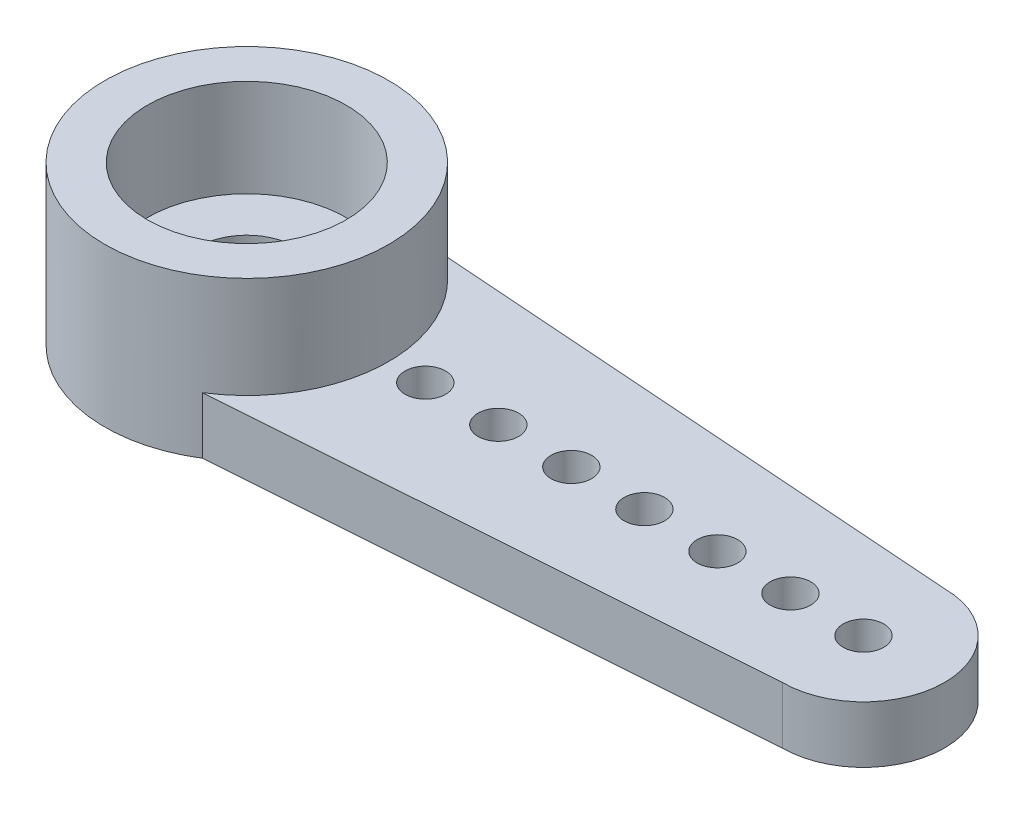
ISO-10303-21;
HEADER;
FILE_DESCRIPTION(('STEP AP214'),'2;1');
FILE_NAME('part.step','',(''),(''),'','','');
FILE_SCHEMA(('AUTOMOTIVE_DESIGN { 1 0 10303 214 1 1 1 1 }'));
ENDSEC;
DATA;
#1=APPLICATION_CONTEXT('core data for automotive mechanical design processes');
#2=APPLICATION_PROTOCOL_DEFINITION('international standard','automotive_design',2000,#1);
#3=PRODUCT_CONTEXT('',#1,'mechanical');
#4=PRODUCT('Part','Part','',(#3));
#5=PRODUCT_RELATED_PRODUCT_CATEGORY('part','',(#4));
#6=PRODUCT_DEFINITION_FORMATION('','',#4);
#7=PRODUCT_DEFINITION_CONTEXT('part definition',#1,'design');
#8=PRODUCT_DEFINITION('design','',#6,#7);
#9=PRODUCT_DEFINITION_SHAPE('','',#8);
#10=(LENGTH_UNIT() NAMED_UNIT(*) SI_UNIT(.MILLI.,.METRE.));
#11=(NAMED_UNIT(*) PLANE_ANGLE_UNIT() SI_UNIT($,.RADIAN.));
#12=(NAMED_UNIT(*) SI_UNIT($,.STERADIAN.) SOLID_ANGLE_UNIT());
#13=UNCERTAINTY_MEASURE_WITH_UNIT(LENGTH_MEASURE(1.E-05),#10,'distance_accuracy_value','');
#14=(GEOMETRIC_REPRESENTATION_CONTEXT(3) GLOBAL_UNCERTAINTY_ASSIGNED_CONTEXT((#13)) GLOBAL_UNIT_ASSIGNED_CONTEXT((#10,
#11,#12)) REPRESENTATION_CONTEXT('',''));
#15=CARTESIAN_POINT('',(0.,0.,0.));
#16=DIRECTION('',(0.,0.,1.));
#17=DIRECTION('',(1.,0.,0.));
#18=AXIS2_PLACEMENT_3D('',#15,#16,#17);
#19=CARTESIAN_POINT('',(-15.2,1.4,0.));
#20=DIRECTION('',(0.,1.,0.));
#21=DIRECTION('',(0.,0.,1.));
#22=AXIS2_PLACEMENT_3D('',#19,#20,#21);
#23=PLANE('',#22);
#24=CARTESIAN_POINT('',(6.2,1.4,0.));
#25=DIRECTION('',(0.,1.,0.));
#26=DIRECTION('',(0.,0.,1.));
#27=AXIS2_PLACEMENT_3D('',#24,#25,#26);
#28=CIRCLE('',#27,0.499999999999997);
#29=CARTESIAN_POINT('',(6.2,1.4,0.500000000000053));
#30=VERTEX_POINT('',#29);
#31=EDGE_CURVE('E125',#30,#30,#28,.T.);
#32=ORIENTED_EDGE('',*,*,#31,.F.);
#33=EDGE_LOOP('',(#32));
#34=FACE_BOUND('',#33,.T.);
#35=CARTESIAN_POINT('',(9.8,1.4,0.));
#36=DIRECTION('',(0.,1.,0.));
#37=DIRECTION('',(0.,0.,1.));
#38=AXIS2_PLACEMENT_3D('',#35,#36,#37);
#39=CIRCLE('',#38,0.499999999999997);
#40=CARTESIAN_POINT('',(9.8,1.4,0.500000000000028));
#41=VERTEX_POINT('',#40);
#42=EDGE_CURVE('E137',#41,#41,#39,.T.);
#43=ORIENTED_EDGE('',*,*,#42,.F.);
#44=EDGE_LOOP('',(#43));
#45=FACE_BOUND('',#44,.T.);
#46=CARTESIAN_POINT('',(13.4,1.4,0.));
#47=DIRECTION('',(0.,1.,0.));
#48=DIRECTION('',(0.,0.,1.));
#49=AXIS2_PLACEMENT_3D('',#46,#47,#48);
#50=CIRCLE('',#49,0.499999999999997);
#51=CARTESIAN_POINT('',(13.4,1.4,0.500000000000003));
#52=VERTEX_POINT('',#51);
#53=EDGE_CURVE('E149',#52,#52,#50,.T.);
#54=ORIENTED_EDGE('',*,*,#53,.F.);
#55=EDGE_LOOP('',(#54));
#56=FACE_BOUND('',#55,.T.);
#57=CARTESIAN_POINT('',(15.2,1.4,0.));
#58=DIRECTION('',(0.,1.,0.));
#59=DIRECTION('',(0.,0.,1.));
#60=AXIS2_PLACEMENT_3D('',#57,#58,#59);
#61=CIRCLE('',#60,0.499999999999997);
#62=CARTESIAN_POINT('',(15.2,1.4,0.49999999999999));
#63=VERTEX_POINT('',#62);
#64=EDGE_CURVE('E155',#63,#63,#61,.T.);
#65=ORIENTED_EDGE('',*,*,#64,.F.);
#66=EDGE_LOOP('',(#65));
#67=FACE_BOUND('',#66,.T.);
#68=CARTESIAN_POINT('',(11.6,1.4,0.));
#69=DIRECTION('',(0.,1.,0.));
#70=DIRECTION('',(0.,0.,1.));
#71=AXIS2_PLACEMENT_3D('',#68,#69,#70);
#72=CIRCLE('',#71,0.499999999999999);
#73=CARTESIAN_POINT('',(11.6,1.4,0.500000000000017));
#74=VERTEX_POINT('',#73);
#75=EDGE_CURVE('E143',#74,#74,#72,.T.);
#76=ORIENTED_EDGE('',*,*,#75,.F.);
#77=EDGE_LOOP('',(#76));
#78=FACE_BOUND('',#77,.T.);
#79=CARTESIAN_POINT('',(8.,1.4,0.));
#80=DIRECTION('',(0.,1.,0.));
#81=DIRECTION('',(0.,0.,1.));
#82=AXIS2_PLACEMENT_3D('',#79,#80,#81);
#83=CIRCLE('',#82,0.499999999999997);
#84=CARTESIAN_POINT('',(8.,1.4,0.500000000000041));
#85=VERTEX_POINT('',#84);
#86=EDGE_CURVE('E131',#85,#85,#83,.T.);
#87=ORIENTED_EDGE('',*,*,#86,.F.);
#88=EDGE_LOOP('',(#87));
#89=FACE_BOUND('',#88,.T.);
#90=CARTESIAN_POINT('',(4.4,1.4,0.));
#91=DIRECTION('',(0.,1.,0.));
#92=DIRECTION('',(0.,0.,1.));
#93=AXIS2_PLACEMENT_3D('',#90,#91,#92);
#94=CIRCLE('',#93,0.499999999999997);
#95=CARTESIAN_POINT('',(4.4,1.4,0.500000000000066));
#96=VERTEX_POINT('',#95);
#97=EDGE_CURVE('E119',#96,#96,#94,.T.);
#98=ORIENTED_EDGE('',*,*,#97,.F.);
#99=EDGE_LOOP('',(#98));
#100=FACE_BOUND('',#99,.T.);
#101=CARTESIAN_POINT('',(0.,1.4,0.));
#102=DIRECTION('',(0.,1.,0.));
#103=DIRECTION('',(0.,0.,1.));
#104=AXIS2_PLACEMENT_3D('',#101,#102,#103);
#105=CIRCLE('',#104,3.5);
#106=CARTESIAN_POINT('',(1.86858471289894,1.4,2.95945791838985));
#107=VERTEX_POINT('',#106);
#108=CARTESIAN_POINT('',(1.86858471289894,1.4,-2.95945791838985));
#109=VERTEX_POINT('',#108);
#110=EDGE_CURVE('E85',#107,#109,#105,.T.);
#111=ORIENTED_EDGE('',*,*,#110,.F.);
#112=DIRECTION('',(0.997420198870011,0.,-0.0717840294641297));
#113=VECTOR('',#112,1.);
#114=CARTESIAN_POINT('',(-14.9001527327747,1.4,4.16629887091939));
#115=LINE('',#114,#113);
#116=CARTESIAN_POINT('',(15.2,1.4,2.));
#117=VERTEX_POINT('',#116);
#118=EDGE_CURVE('E99',#107,#117,#115,.T.);
#119=ORIENTED_EDGE('',*,*,#118,.T.);
#120=CARTESIAN_POINT('',(15.2,1.4,0.));
#121=DIRECTION('',(0.,1.,0.));
#122=DIRECTION('',(0.,0.,-1.));
#123=AXIS2_PLACEMENT_3D('',#120,#121,#122);
#124=CIRCLE('',#123,2.);
#125=CARTESIAN_POINT('',(15.2,1.4,-2.));
#126=VERTEX_POINT('',#125);
#127=EDGE_CURVE('E161',#117,#126,#124,.T.);
#128=ORIENTED_EDGE('',*,*,#127,.T.);
#129=DIRECTION('',(-0.997420198870011,0.,-0.0717840294641295));
#130=VECTOR('',#129,1.);
#131=CARTESIAN_POINT('',(-14.9001527327747,1.4,-4.16629887091939));
#132=LINE('',#131,#130);
#133=EDGE_CURVE('E96',#126,#109,#132,.T.);
#134=ORIENTED_EDGE('',*,*,#133,.T.);
#135=EDGE_LOOP('',(#111,#119,#128,#134));
#136=FACE_BOUND('',#135,.T.);
#137=ADVANCED_FACE('F32',(#34,#45,#56,#67,#78,#89,#100,#136),#23,.T.);
#138=CARTESIAN_POINT('',(-15.2,0.,0.));
#139=DIRECTION('',(0.,1.,0.));
#140=DIRECTION('',(0.,0.,1.));
#141=AXIS2_PLACEMENT_3D('',#138,#139,#140);
#142=PLANE('',#141);
#143=CARTESIAN_POINT('',(0.,0.,0.));
#144=DIRECTION('',(0.,-1.,0.));
#145=DIRECTION('',(0.,0.,-1.));
#146=AXIS2_PLACEMENT_3D('',#143,#144,#145);
#147=CIRCLE('',#146,2.35);
#148=CARTESIAN_POINT('',(0.,0.,-2.35));
#149=VERTEX_POINT('',#148);
#150=EDGE_CURVE('E111',#149,#149,#147,.T.);
#151=ORIENTED_EDGE('',*,*,#150,.F.);
#152=EDGE_LOOP('',(#151));
#153=FACE_BOUND('',#152,.T.);
#154=CARTESIAN_POINT('',(15.2,0.,0.));
#155=DIRECTION('',(0.,1.,0.));
#156=DIRECTION('',(0.,0.,1.));
#157=AXIS2_PLACEMENT_3D('',#154,#155,#156);
#158=CIRCLE('',#157,0.499999999999997);
#159=CARTESIAN_POINT('',(15.2,0.,0.49999999999999));
#160=VERTEX_POINT('',#159);
#161=EDGE_CURVE('E152',#160,#160,#158,.T.);
#162=ORIENTED_EDGE('',*,*,#161,.T.);
#163=EDGE_LOOP('',(#162));
#164=FACE_BOUND('',#163,.T.);
#165=CARTESIAN_POINT('',(13.4,0.,0.));
#166=DIRECTION('',(0.,1.,0.));
#167=DIRECTION('',(0.,0.,1.));
#168=AXIS2_PLACEMENT_3D('',#165,#166,#167);
#169=CIRCLE('',#168,0.499999999999997);
#170=CARTESIAN_POINT('',(13.4,0.,0.500000000000003));
#171=VERTEX_POINT('',#170);
#172=EDGE_CURVE('E146',#171,#171,#169,.T.);
#173=ORIENTED_EDGE('',*,*,#172,.T.);
#174=EDGE_LOOP('',(#173));
#175=FACE_BOUND('',#174,.T.);
#176=CARTESIAN_POINT('',(11.6,0.,0.));
#177=DIRECTION('',(0.,1.,0.));
#178=DIRECTION('',(0.,0.,1.));
#179=AXIS2_PLACEMENT_3D('',#176,#177,#178);
#180=CIRCLE('',#179,0.499999999999999);
#181=CARTESIAN_POINT('',(11.6,0.,0.500000000000017));
#182=VERTEX_POINT('',#181);
#183=EDGE_CURVE('E140',#182,#182,#180,.T.);
#184=ORIENTED_EDGE('',*,*,#183,.T.);
#185=EDGE_LOOP('',(#184));
#186=FACE_BOUND('',#185,.T.);
#187=CARTESIAN_POINT('',(9.8,0.,0.));
#188=DIRECTION('',(0.,1.,0.));
#189=DIRECTION('',(0.,0.,1.));
#190=AXIS2_PLACEMENT_3D('',#187,#188,#189);
#191=CIRCLE('',#190,0.499999999999997);
#192=CARTESIAN_POINT('',(9.8,0.,0.500000000000028));
#193=VERTEX_POINT('',#192);
#194=EDGE_CURVE('E134',#193,#193,#191,.T.);
#195=ORIENTED_EDGE('',*,*,#194,.T.);
#196=EDGE_LOOP('',(#195));
#197=FACE_BOUND('',#196,.T.);
#198=CARTESIAN_POINT('',(8.,0.,0.));
#199=DIRECTION('',(0.,1.,0.));
#200=DIRECTION('',(0.,0.,1.));
#201=AXIS2_PLACEMENT_3D('',#198,#199,#200);
#202=CIRCLE('',#201,0.499999999999997);
#203=CARTESIAN_POINT('',(8.,0.,0.500000000000041));
#204=VERTEX_POINT('',#203);
#205=EDGE_CURVE('E128',#204,#204,#202,.T.);
#206=ORIENTED_EDGE('',*,*,#205,.T.);
#207=EDGE_LOOP('',(#206));
#208=FACE_BOUND('',#207,.T.);
#209=CARTESIAN_POINT('',(6.2,0.,0.));
#210=DIRECTION('',(0.,1.,0.));
#211=DIRECTION('',(0.,0.,1.));
#212=AXIS2_PLACEMENT_3D('',#209,#210,#211);
#213=CIRCLE('',#212,0.499999999999997);
#214=CARTESIAN_POINT('',(6.2,0.,0.500000000000053));
#215=VERTEX_POINT('',#214);
#216=EDGE_CURVE('E122',#215,#215,#213,.T.);
#217=ORIENTED_EDGE('',*,*,#216,.T.);
#218=EDGE_LOOP('',(#217));
#219=FACE_BOUND('',#218,.T.);
#220=CARTESIAN_POINT('',(4.4,0.,0.));
#221=DIRECTION('',(0.,1.,0.));
#222=DIRECTION('',(0.,0.,1.));
#223=AXIS2_PLACEMENT_3D('',#220,#221,#222);
#224=CIRCLE('',#223,0.499999999999997);
#225=CARTESIAN_POINT('',(4.4,0.,0.500000000000066));
#226=VERTEX_POINT('',#225);
#227=EDGE_CURVE('E116',#226,#226,#224,.T.);
#228=ORIENTED_EDGE('',*,*,#227,.T.);
#229=EDGE_LOOP('',(#228));
#230=FACE_BOUND('',#229,.T.);
#231=CARTESIAN_POINT('',(0.,0.,0.));
#232=DIRECTION('',(0.,-1.,0.));
#233=DIRECTION('',(0.,0.,-1.));
#234=AXIS2_PLACEMENT_3D('',#231,#232,#233);
#235=CIRCLE('',#234,3.5);
#236=CARTESIAN_POINT('',(1.86858471289894,0.,2.95945791838985));
#237=VERTEX_POINT('',#236);
#238=CARTESIAN_POINT('',(1.86858471289894,0.,-2.95945791838985));
#239=VERTEX_POINT('',#238);
#240=EDGE_CURVE('E70',#237,#239,#235,.T.);
#241=ORIENTED_EDGE('',*,*,#240,.T.);
#242=DIRECTION('',(0.997420198870011,0.,0.0717840294641295));
#243=VECTOR('',#242,1.);
#244=CARTESIAN_POINT('',(1.86858471289894,0.,-2.95945791838985));
#245=LINE('',#244,#243);
#246=CARTESIAN_POINT('',(15.2,0.,-2.));
#247=VERTEX_POINT('',#246);
#248=EDGE_CURVE('E75',#239,#247,#245,.T.);
#249=ORIENTED_EDGE('',*,*,#248,.T.);
#250=CARTESIAN_POINT('',(15.2,0.,0.));
#251=DIRECTION('',(0.,1.,0.));
#252=DIRECTION('',(0.,0.,-1.));
#253=AXIS2_PLACEMENT_3D('',#250,#251,#252);
#254=CIRCLE('',#253,2.);
#255=CARTESIAN_POINT('',(15.2,0.,1.99999999999999));
#256=VERTEX_POINT('',#255);
#257=EDGE_CURVE('E158',#256,#247,#254,.T.);
#258=ORIENTED_EDGE('',*,*,#257,.F.);
#259=DIRECTION('',(-0.997420198870011,0.,0.0717840294641296));
#260=VECTOR('',#259,1.);
#261=CARTESIAN_POINT('',(15.2,0.,2.));
#262=LINE('',#261,#260);
#263=EDGE_CURVE('E47',#256,#237,#262,.T.);
#264=ORIENTED_EDGE('',*,*,#263,.T.);
#265=EDGE_LOOP('',(#241,#249,#258,#264));
#266=FACE_BOUND('',#265,.T.);
#267=ADVANCED_FACE('F72',(#153,#164,#175,#186,#197,#208,#219,#230,#266),#142,.F.);
#268=CARTESIAN_POINT('',(15.2,1.4,0.));
#269=DIRECTION('',(0.,-1.,0.));
#270=DIRECTION('',(0.,0.,-1.));
#271=AXIS2_PLACEMENT_3D('',#268,#269,#270);
#272=CYLINDRICAL_SURFACE('',#271,2.);
#273=ORIENTED_EDGE('',*,*,#257,.T.);
#274=DIRECTION('',(0.,-1.,0.));
#275=VECTOR('',#274,1.);
#276=CARTESIAN_POINT('',(15.2,1.4,-2.00000000000001));
#277=LINE('',#276,#275);
#278=EDGE_CURVE('E92',#126,#247,#277,.T.);
#279=ORIENTED_EDGE('',*,*,#278,.F.);
#280=ORIENTED_EDGE('',*,*,#127,.F.);
#281=DIRECTION('',(0.,-1.,0.));
#282=VECTOR('',#281,1.);
#283=CARTESIAN_POINT('',(15.2,1.4,1.99999999999999));
#284=LINE('',#283,#282);
#285=EDGE_CURVE('E40',#117,#256,#284,.T.);
#286=ORIENTED_EDGE('',*,*,#285,.T.);
#287=EDGE_LOOP('',(#273,#279,#280,#286));
#288=FACE_BOUND('',#287,.T.);
#289=ADVANCED_FACE('F34',(#288),#272,.T.);
#290=CARTESIAN_POINT('',(15.2,1.4,0.));
#291=DIRECTION('',(0.,-1.,0.));
#292=DIRECTION('',(0.,0.,-1.));
#293=AXIS2_PLACEMENT_3D('',#290,#291,#292);
#294=CYLINDRICAL_SURFACE('',#293,0.499999999999997);
#295=ORIENTED_EDGE('',*,*,#64,.T.);
#296=EDGE_LOOP('',(#295));
#297=FACE_BOUND('',#296,.T.);
#298=ORIENTED_EDGE('',*,*,#161,.F.);
#299=EDGE_LOOP('',(#298));
#300=FACE_BOUND('',#299,.T.);
#301=ADVANCED_FACE('F220',(#297,#300),#294,.F.);
#302=CARTESIAN_POINT('',(13.4,1.4,0.));
#303=DIRECTION('',(0.,-1.,0.));
#304=DIRECTION('',(0.,0.,-1.));
#305=AXIS2_PLACEMENT_3D('',#302,#303,#304);
#306=CYLINDRICAL_SURFACE('',#305,0.499999999999997);
#307=ORIENTED_EDGE('',*,*,#53,.T.);
#308=EDGE_LOOP('',(#307));
#309=FACE_BOUND('',#308,.T.);
#310=ORIENTED_EDGE('',*,*,#172,.F.);
#311=EDGE_LOOP('',(#310));
#312=FACE_BOUND('',#311,.T.);
#313=ADVANCED_FACE('F223',(#309,#312),#306,.F.);
#314=CARTESIAN_POINT('',(11.6,1.4,0.));
#315=DIRECTION('',(0.,-1.,0.));
#316=DIRECTION('',(0.,0.,-1.));
#317=AXIS2_PLACEMENT_3D('',#314,#315,#316);
#318=CYLINDRICAL_SURFACE('',#317,0.499999999999999);
#319=ORIENTED_EDGE('',*,*,#75,.T.);
#320=EDGE_LOOP('',(#319));
#321=FACE_BOUND('',#320,.T.);
#322=ORIENTED_EDGE('',*,*,#183,.F.);
#323=EDGE_LOOP('',(#322));
#324=FACE_BOUND('',#323,.T.);
#325=ADVANCED_FACE('F227',(#321,#324),#318,.F.);
#326=CARTESIAN_POINT('',(9.8,1.4,0.));
#327=DIRECTION('',(0.,-1.,0.));
#328=DIRECTION('',(0.,0.,-1.));
#329=AXIS2_PLACEMENT_3D('',#326,#327,#328);
#330=CYLINDRICAL_SURFACE('',#329,0.499999999999997);
#331=ORIENTED_EDGE('',*,*,#42,.T.);
#332=EDGE_LOOP('',(#331));
#333=FACE_BOUND('',#332,.T.);
#334=ORIENTED_EDGE('',*,*,#194,.F.);
#335=EDGE_LOOP('',(#334));
#336=FACE_BOUND('',#335,.T.);
#337=ADVANCED_FACE('F231',(#333,#336),#330,.F.);
#338=CARTESIAN_POINT('',(8.,1.4,0.));
#339=DIRECTION('',(0.,-1.,0.));
#340=DIRECTION('',(0.,0.,-1.));
#341=AXIS2_PLACEMENT_3D('',#338,#339,#340);
#342=CYLINDRICAL_SURFACE('',#341,0.499999999999997);
#343=ORIENTED_EDGE('',*,*,#86,.T.);
#344=EDGE_LOOP('',(#343));
#345=FACE_BOUND('',#344,.T.);
#346=ORIENTED_EDGE('',*,*,#205,.F.);
#347=EDGE_LOOP('',(#346));
#348=FACE_BOUND('',#347,.T.);
#349=ADVANCED_FACE('F209',(#345,#348),#342,.F.);
#350=CARTESIAN_POINT('',(6.2,1.4,0.));
#351=DIRECTION('',(0.,-1.,0.));
#352=DIRECTION('',(0.,0.,-1.));
#353=AXIS2_PLACEMENT_3D('',#350,#351,#352);
#354=CYLINDRICAL_SURFACE('',#353,0.499999999999997);
#355=ORIENTED_EDGE('',*,*,#31,.T.);
#356=EDGE_LOOP('',(#355));
#357=FACE_BOUND('',#356,.T.);
#358=ORIENTED_EDGE('',*,*,#216,.F.);
#359=EDGE_LOOP('',(#358));
#360=FACE_BOUND('',#359,.T.);
#361=ADVANCED_FACE('F203',(#357,#360),#354,.F.);
#362=CARTESIAN_POINT('',(4.4,1.4,0.));
#363=DIRECTION('',(0.,-1.,0.));
#364=DIRECTION('',(0.,0.,-1.));
#365=AXIS2_PLACEMENT_3D('',#362,#363,#364);
#366=CYLINDRICAL_SURFACE('',#365,0.499999999999997);
#367=ORIENTED_EDGE('',*,*,#97,.T.);
#368=EDGE_LOOP('',(#367));
#369=FACE_BOUND('',#368,.T.);
#370=ORIENTED_EDGE('',*,*,#227,.F.);
#371=EDGE_LOOP('',(#370));
#372=FACE_BOUND('',#371,.T.);
#373=ADVANCED_FACE('F182',(#369,#372),#366,.F.);
#374=CARTESIAN_POINT('',(0.,1.,0.));
#375=DIRECTION('',(0.,-1.,0.));
#376=DIRECTION('',(0.,0.,-1.));
#377=AXIS2_PLACEMENT_3D('',#374,#375,#376);
#378=CYLINDRICAL_SURFACE('',#377,2.35);
#379=CARTESIAN_POINT('',(0.,1.,0.));
#380=DIRECTION('',(0.,-1.,0.));
#381=DIRECTION('',(0.,0.,-1.));
#382=AXIS2_PLACEMENT_3D('',#379,#380,#381);
#383=CIRCLE('',#382,2.35);
#384=CARTESIAN_POINT('',(0.,1.,-2.35));
#385=VERTEX_POINT('',#384);
#386=EDGE_CURVE('E113',#385,#385,#383,.T.);
#387=ORIENTED_EDGE('',*,*,#386,.F.);
#388=EDGE_LOOP('',(#387));
#389=FACE_BOUND('',#388,.T.);
#390=ORIENTED_EDGE('',*,*,#150,.T.);
#391=EDGE_LOOP('',(#390));
#392=FACE_BOUND('',#391,.T.);
#393=ADVANCED_FACE('F176',(#389,#392),#378,.F.);
#394=CARTESIAN_POINT('',(0.,1.,0.));
#395=DIRECTION('',(0.,-1.,0.));
#396=DIRECTION('',(0.,0.,-1.));
#397=AXIS2_PLACEMENT_3D('',#394,#395,#396);
#398=PLANE('',#397);
#399=CARTESIAN_POINT('',(0.,1.,0.));
#400=DIRECTION('',(0.,-1.,0.));
#401=DIRECTION('',(0.,0.,-1.));
#402=AXIS2_PLACEMENT_3D('',#399,#400,#401);
#403=CIRCLE('',#402,1.2);
#404=CARTESIAN_POINT('',(0.,1.,-1.2));
#405=VERTEX_POINT('',#404);
#406=EDGE_CURVE('E104',#405,#405,#403,.T.);
#407=ORIENTED_EDGE('',*,*,#406,.F.);
#408=EDGE_LOOP('',(#407));
#409=FACE_BOUND('',#408,.T.);
#410=ORIENTED_EDGE('',*,*,#386,.T.);
#411=EDGE_LOOP('',(#410));
#412=FACE_BOUND('',#411,.T.);
#413=ADVANCED_FACE('F172',(#409,#412),#398,.T.);
#414=CARTESIAN_POINT('',(0.,3.9,0.));
#415=DIRECTION('',(0.,1.,0.));
#416=DIRECTION('',(0.,0.,1.));
#417=AXIS2_PLACEMENT_3D('',#414,#415,#416);
#418=PLANE('',#417);
#419=CARTESIAN_POINT('',(0.,3.9,0.));
#420=DIRECTION('',(0.,1.,0.));
#421=DIRECTION('',(0.,0.,1.));
#422=AXIS2_PLACEMENT_3D('',#419,#420,#421);
#423=CIRCLE('',#422,3.5);
#424=CARTESIAN_POINT('',(0.,3.9,3.5));
#425=VERTEX_POINT('',#424);
#426=EDGE_CURVE('E108',#425,#425,#423,.T.);
#427=ORIENTED_EDGE('',*,*,#426,.T.);
#428=EDGE_LOOP('',(#427));
#429=FACE_BOUND('',#428,.T.);
#430=CARTESIAN_POINT('',(0.,3.9,0.));
#431=DIRECTION('',(0.,1.,0.));
#432=DIRECTION('',(0.,0.,1.));
#433=AXIS2_PLACEMENT_3D('',#430,#431,#432);
#434=CIRCLE('',#433,2.45);
#435=CARTESIAN_POINT('',(0.,3.9,2.45));
#436=VERTEX_POINT('',#435);
#437=EDGE_CURVE('E105',#436,#436,#434,.T.);
#438=ORIENTED_EDGE('',*,*,#437,.F.);
#439=EDGE_LOOP('',(#438));
#440=FACE_BOUND('',#439,.T.);
#441=ADVANCED_FACE('F175',(#429,#440),#418,.T.);
#442=CARTESIAN_POINT('',(0.,3.9,0.));
#443=DIRECTION('',(0.,-1.,0.));
#444=DIRECTION('',(0.,0.,-1.));
#445=AXIS2_PLACEMENT_3D('',#442,#443,#444);
#446=CYLINDRICAL_SURFACE('',#445,3.5);
#447=DIRECTION('',(0.,-1.,0.));
#448=VECTOR('',#447,1.);
#449=CARTESIAN_POINT('',(1.86858471289894,3.9,-2.95945791838985));
#450=LINE('',#449,#448);
#451=EDGE_CURVE('E79',#109,#239,#450,.T.);
#452=ORIENTED_EDGE('',*,*,#451,.T.);
#453=ORIENTED_EDGE('',*,*,#240,.F.);
#454=DIRECTION('',(0.,-1.,0.));
#455=VECTOR('',#454,1.);
#456=CARTESIAN_POINT('',(1.86858471289894,3.9,2.95945791838985));
#457=LINE('',#456,#455);
#458=EDGE_CURVE('E88',#107,#237,#457,.T.);
#459=ORIENTED_EDGE('',*,*,#458,.F.);
#460=ORIENTED_EDGE('',*,*,#110,.T.);
#461=EDGE_LOOP('',(#452,#453,#459,#460));
#462=FACE_BOUND('',#461,.T.);
#463=ORIENTED_EDGE('',*,*,#426,.F.);
#464=EDGE_LOOP('',(#463));
#465=FACE_BOUND('',#464,.T.);
#466=ADVANCED_FACE('F82',(#462,#465),#446,.T.);
#467=CARTESIAN_POINT('',(0.,3.9,0.));
#468=DIRECTION('',(0.,-1.,0.));
#469=DIRECTION('',(0.,0.,-1.));
#470=AXIS2_PLACEMENT_3D('',#467,#468,#469);
#471=CYLINDRICAL_SURFACE('',#470,2.45);
#472=CARTESIAN_POINT('',(0.,1.5,0.));
#473=DIRECTION('',(0.,1.,0.));
#474=DIRECTION('',(0.,0.,1.));
#475=AXIS2_PLACEMENT_3D('',#472,#473,#474);
#476=CIRCLE('',#475,2.45);
#477=CARTESIAN_POINT('',(0.,1.5,2.45));
#478=VERTEX_POINT('',#477);
#479=EDGE_CURVE('E11',#478,#478,#476,.T.);
#480=ORIENTED_EDGE('',*,*,#479,.F.);
#481=EDGE_LOOP('',(#480));
#482=FACE_BOUND('',#481,.T.);
#483=ORIENTED_EDGE('',*,*,#437,.T.);
#484=EDGE_LOOP('',(#483));
#485=FACE_BOUND('',#484,.T.);
#486=ADVANCED_FACE('F319',(#482,#485),#471,.F.);
#487=CARTESIAN_POINT('',(0.,0.,0.));
#488=DIRECTION('',(0.,1.,0.));
#489=DIRECTION('',(0.,0.,1.));
#490=AXIS2_PLACEMENT_3D('',#487,#488,#489);
#491=CYLINDRICAL_SURFACE('',#490,1.2);
#492=ORIENTED_EDGE('',*,*,#406,.T.);
#493=EDGE_LOOP('',(#492));
#494=FACE_BOUND('',#493,.T.);
#495=CARTESIAN_POINT('',(0.,1.5,0.));
#496=DIRECTION('',(0.,1.,0.));
#497=DIRECTION('',(0.,0.,1.));
#498=AXIS2_PLACEMENT_3D('',#495,#496,#497);
#499=CIRCLE('',#498,1.2);
#500=CARTESIAN_POINT('',(0.,1.5,1.2));
#501=VERTEX_POINT('',#500);
#502=EDGE_CURVE('E101',#501,#501,#499,.T.);
#503=ORIENTED_EDGE('',*,*,#502,.T.);
#504=EDGE_LOOP('',(#503));
#505=FACE_BOUND('',#504,.T.);
#506=ADVANCED_FACE('F169',(#494,#505),#491,.F.);
#507=CARTESIAN_POINT('',(0.,1.5,0.));
#508=DIRECTION('',(0.,1.,0.));
#509=DIRECTION('',(0.,0.,1.));
#510=AXIS2_PLACEMENT_3D('',#507,#508,#509);
#511=PLANE('',#510);
#512=ORIENTED_EDGE('',*,*,#479,.T.);
#513=EDGE_LOOP('',(#512));
#514=FACE_BOUND('',#513,.T.);
#515=ORIENTED_EDGE('',*,*,#502,.F.);
#516=EDGE_LOOP('',(#515));
#517=FACE_BOUND('',#516,.T.);
#518=ADVANCED_FACE('F305',(#514,#517),#511,.T.);
#519=CARTESIAN_POINT('',(1.86858471289894,3.9,-2.95945791838985));
#520=DIRECTION('',(0.0717840294641295,0.,-0.997420198870011));
#521=DIRECTION('',(-0.997420198870011,0.,-0.0717840294641295));
#522=AXIS2_PLACEMENT_3D('',#519,#520,#521);
#523=PLANE('',#522);
#524=ORIENTED_EDGE('',*,*,#278,.T.);
#525=ORIENTED_EDGE('',*,*,#248,.F.);
#526=ORIENTED_EDGE('',*,*,#451,.F.);
#527=ORIENTED_EDGE('',*,*,#133,.F.);
#528=EDGE_LOOP('',(#524,#525,#526,#527));
#529=FACE_BOUND('',#528,.T.);
#530=ADVANCED_FACE('F90',(#529),#523,.T.);
#531=CARTESIAN_POINT('',(15.2,3.9,2.));
#532=DIRECTION('',(0.0717840294641297,0.,0.997420198870011));
#533=DIRECTION('',(0.997420198870011,0.,-0.0717840294641297));
#534=AXIS2_PLACEMENT_3D('',#531,#532,#533);
#535=PLANE('',#534);
#536=ORIENTED_EDGE('',*,*,#458,.T.);
#537=ORIENTED_EDGE('',*,*,#263,.F.);
#538=ORIENTED_EDGE('',*,*,#285,.F.);
#539=ORIENTED_EDGE('',*,*,#118,.F.);
#540=EDGE_LOOP('',(#536,#537,#538,#539));
#541=FACE_BOUND('',#540,.T.);
#542=ADVANCED_FACE('F344',(#541),#535,.T.);
#543=CLOSED_SHELL('',(#137,#267,#289,#301,#313,#325,#337,#349,#361,#373,#393,#413,#441,#466,
#486,#506,#518,#530,#542));
#544=MANIFOLD_SOLID_BREP('B2',#543);
#545=ADVANCED_BREP_SHAPE_REPRESENTATION('',(#18,#544),#14);
#546=SHAPE_DEFINITION_REPRESENTATION(#9,#545);
ENDSEC;
END-ISO-10303-21;
